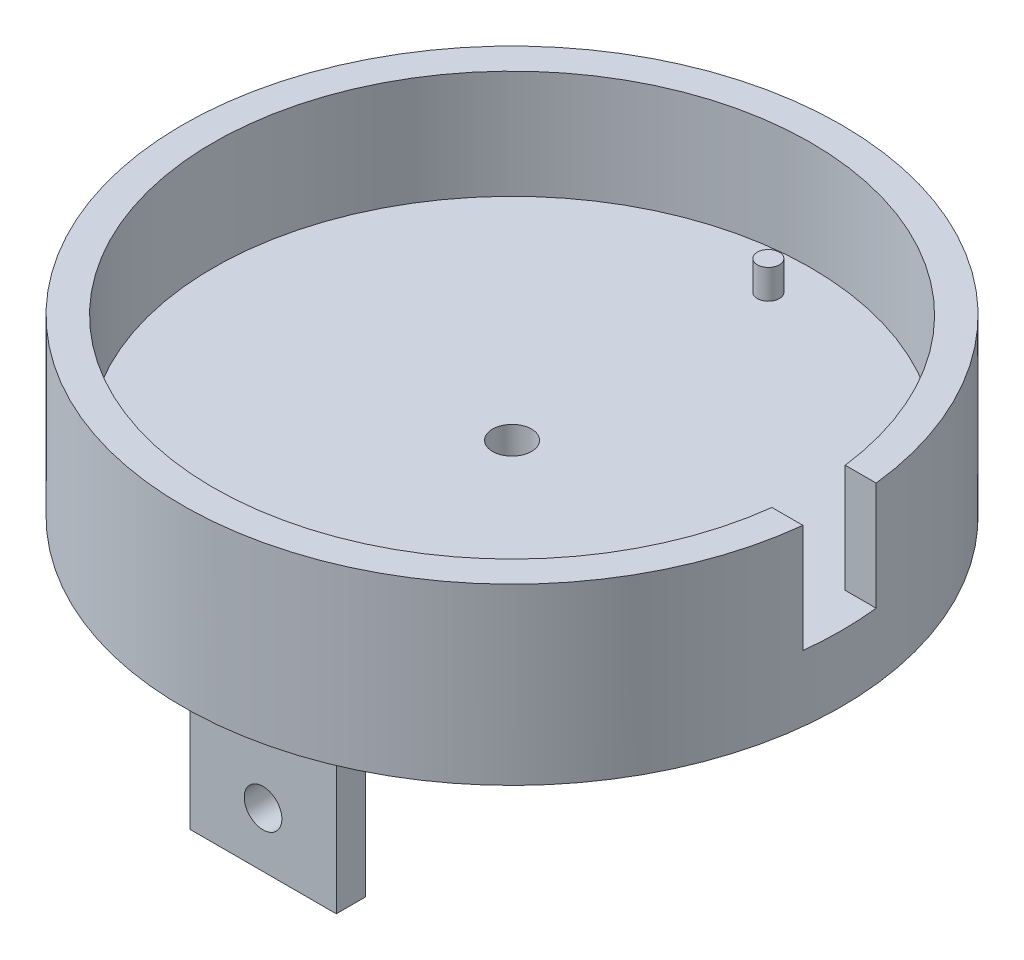
ISO-10303-21;
HEADER;
FILE_DESCRIPTION(('STEP AP214'),'2;1');
FILE_NAME('part.step','',(''),(''),'','','');
FILE_SCHEMA(('AUTOMOTIVE_DESIGN { 1 0 10303 214 1 1 1 1 }'));
ENDSEC;
DATA;
#1=APPLICATION_CONTEXT('core data for automotive mechanical design processes');
#2=APPLICATION_PROTOCOL_DEFINITION('international standard','automotive_design',2000,#1);
#3=PRODUCT_CONTEXT('',#1,'mechanical');
#4=PRODUCT('Part','Part','',(#3));
#5=PRODUCT_RELATED_PRODUCT_CATEGORY('part','',(#4));
#6=PRODUCT_DEFINITION_FORMATION('','',#4);
#7=PRODUCT_DEFINITION_CONTEXT('part definition',#1,'design');
#8=PRODUCT_DEFINITION('design','',#6,#7);
#9=PRODUCT_DEFINITION_SHAPE('','',#8);
#10=(LENGTH_UNIT() NAMED_UNIT(*) SI_UNIT(.MILLI.,.METRE.));
#11=(NAMED_UNIT(*) PLANE_ANGLE_UNIT() SI_UNIT($,.RADIAN.));
#12=(NAMED_UNIT(*) SI_UNIT($,.STERADIAN.) SOLID_ANGLE_UNIT());
#13=UNCERTAINTY_MEASURE_WITH_UNIT(LENGTH_MEASURE(1.E-05),#10,'distance_accuracy_value','');
#14=(GEOMETRIC_REPRESENTATION_CONTEXT(3) GLOBAL_UNCERTAINTY_ASSIGNED_CONTEXT((#13)) GLOBAL_UNIT_ASSIGNED_CONTEXT((#10,
#11,#12)) REPRESENTATION_CONTEXT('',''));
#15=CARTESIAN_POINT('',(0.,0.,0.));
#16=DIRECTION('',(0.,0.,1.));
#17=DIRECTION('',(1.,0.,0.));
#18=AXIS2_PLACEMENT_3D('',#15,#16,#17);
#19=CARTESIAN_POINT('',(0.,0.,0.));
#20=DIRECTION('',(0.,-1.,0.));
#21=DIRECTION('',(0.,0.,-1.));
#22=AXIS2_PLACEMENT_3D('',#19,#20,#21);
#23=PLANE('',#22);
#24=DIRECTION('',(-1.,0.,0.));
#25=VECTOR('',#24,1.);
#26=CARTESIAN_POINT('',(-12.7,0.,38.1));
#27=LINE('',#26,#25);
#28=CARTESIAN_POINT('',(19.05,0.,38.1));
#29=VERTEX_POINT('',#28);
#30=CARTESIAN_POINT('',(-19.05,0.,38.1));
#31=VERTEX_POINT('',#30);
#32=EDGE_CURVE('E187',#29,#31,#27,.T.);
#33=ORIENTED_EDGE('',*,*,#32,.T.);
#34=DIRECTION('',(0.,0.,1.));
#35=VECTOR('',#34,1.);
#36=CARTESIAN_POINT('',(-19.05,0.,43.18));
#37=LINE('',#36,#35);
#38=CARTESIAN_POINT('',(-19.05,0.,49.53));
#39=VERTEX_POINT('',#38);
#40=EDGE_CURVE('E273',#31,#39,#37,.T.);
#41=ORIENTED_EDGE('',*,*,#40,.T.);
#42=DIRECTION('',(1.,0.,0.));
#43=VECTOR('',#42,1.);
#44=CARTESIAN_POINT('',(12.7,0.,49.53));
#45=LINE('',#44,#43);
#46=CARTESIAN_POINT('',(19.05,0.,49.53));
#47=VERTEX_POINT('',#46);
#48=EDGE_CURVE('E266',#39,#47,#45,.T.);
#49=ORIENTED_EDGE('',*,*,#48,.T.);
#50=DIRECTION('',(0.,0.,-1.));
#51=VECTOR('',#50,1.);
#52=CARTESIAN_POINT('',(19.05,0.,38.1));
#53=LINE('',#52,#51);
#54=EDGE_CURVE('E270',#47,#29,#53,.T.);
#55=ORIENTED_EDGE('',*,*,#54,.T.);
#56=EDGE_LOOP('',(#33,#41,#49,#55));
#57=FACE_BOUND('',#56,.T.);
#58=DIRECTION('',(1.,0.,0.));
#59=VECTOR('',#58,1.);
#60=CARTESIAN_POINT('',(-12.7,0.,-38.1));
#61=LINE('',#60,#59);
#62=CARTESIAN_POINT('',(-19.05,0.,-38.1));
#63=VERTEX_POINT('',#62);
#64=CARTESIAN_POINT('',(19.05,0.,-38.1));
#65=VERTEX_POINT('',#64);
#66=EDGE_CURVE('E176',#63,#65,#61,.T.);
#67=ORIENTED_EDGE('',*,*,#66,.T.);
#68=DIRECTION('',(0.,0.,-1.));
#69=VECTOR('',#68,1.);
#70=CARTESIAN_POINT('',(19.05,0.,-43.18));
#71=LINE('',#70,#69);
#72=CARTESIAN_POINT('',(19.05,0.,-49.53));
#73=VERTEX_POINT('',#72);
#74=EDGE_CURVE('E281',#65,#73,#71,.T.);
#75=ORIENTED_EDGE('',*,*,#74,.T.);
#76=DIRECTION('',(-1.,0.,0.));
#77=VECTOR('',#76,1.);
#78=CARTESIAN_POINT('',(-12.7,0.,-49.53));
#79=LINE('',#78,#77);
#80=CARTESIAN_POINT('',(-19.05,0.,-49.53));
#81=VERTEX_POINT('',#80);
#82=EDGE_CURVE('E279',#73,#81,#79,.T.);
#83=ORIENTED_EDGE('',*,*,#82,.T.);
#84=DIRECTION('',(0.,0.,1.));
#85=VECTOR('',#84,1.);
#86=CARTESIAN_POINT('',(-19.05,0.,-38.1));
#87=LINE('',#86,#85);
#88=EDGE_CURVE('E276',#81,#63,#87,.T.);
#89=ORIENTED_EDGE('',*,*,#88,.T.);
#90=EDGE_LOOP('',(#67,#75,#83,#89));
#91=FACE_BOUND('',#90,.T.);
#92=CARTESIAN_POINT('',(0.,0.,0.));
#93=DIRECTION('',(0.,-1.,0.));
#94=DIRECTION('',(0.,0.,-1.));
#95=AXIS2_PLACEMENT_3D('',#92,#93,#94);
#96=CIRCLE('',#95,3.3782);
#97=CARTESIAN_POINT('',(0.,0.,-3.3782));
#98=VERTEX_POINT('',#97);
#99=EDGE_CURVE('E225',#98,#98,#96,.T.);
#100=ORIENTED_EDGE('',*,*,#99,.F.);
#101=EDGE_LOOP('',(#100));
#102=FACE_BOUND('',#101,.T.);
#103=CARTESIAN_POINT('',(0.,0.,0.));
#104=DIRECTION('',(0.,-1.,0.));
#105=DIRECTION('',(0.,0.,-1.));
#106=AXIS2_PLACEMENT_3D('',#103,#104,#105);
#107=CIRCLE('',#106,57.15);
#108=CARTESIAN_POINT('',(0.,0.,-57.15));
#109=VERTEX_POINT('',#108);
#110=EDGE_CURVE('E263',#109,#109,#107,.T.);
#111=ORIENTED_EDGE('',*,*,#110,.T.);
#112=EDGE_LOOP('',(#111));
#113=FACE_BOUND('',#112,.T.);
#114=ADVANCED_FACE('F37',(#57,#91,#102,#113),#23,.T.);
#115=CARTESIAN_POINT('',(0.,0.,0.));
#116=DIRECTION('',(0.,-1.,0.));
#117=DIRECTION('',(0.,0.,-1.));
#118=AXIS2_PLACEMENT_3D('',#115,#116,#117);
#119=CYLINDRICAL_SURFACE('',#118,57.15);
#120=DIRECTION('',(0.,-1.,0.));
#121=VECTOR('',#120,1.);
#122=CARTESIAN_POINT('',(56.7961266284947,0.,-6.35));
#123=LINE('',#122,#121);
#124=CARTESIAN_POINT('',(56.7961266284947,11.43,-6.35));
#125=VERTEX_POINT('',#124);
#126=CARTESIAN_POINT('',(56.7961266284947,30.226,-6.35));
#127=VERTEX_POINT('',#126);
#128=EDGE_CURVE('E250',#125,#127,#123,.F.);
#129=ORIENTED_EDGE('',*,*,#128,.F.);
#130=CARTESIAN_POINT('',(0.,11.43,0.));
#131=DIRECTION('',(0.,-1.,0.));
#132=DIRECTION('',(0.,0.,-1.));
#133=AXIS2_PLACEMENT_3D('',#130,#131,#132);
#134=CIRCLE('',#133,57.15);
#135=CARTESIAN_POINT('',(56.7961266284947,11.43,6.35));
#136=VERTEX_POINT('',#135);
#137=EDGE_CURVE('E252',#136,#125,#134,.F.);
#138=ORIENTED_EDGE('',*,*,#137,.F.);
#139=DIRECTION('',(0.,-1.,0.));
#140=VECTOR('',#139,1.);
#141=CARTESIAN_POINT('',(56.7961266284947,0.,6.35));
#142=LINE('',#141,#140);
#143=CARTESIAN_POINT('',(56.7961266284947,30.226,6.35));
#144=VERTEX_POINT('',#143);
#145=EDGE_CURVE('E243',#144,#136,#142,.T.);
#146=ORIENTED_EDGE('',*,*,#145,.F.);
#147=CARTESIAN_POINT('',(0.,30.226,0.));
#148=DIRECTION('',(0.,-1.,0.));
#149=DIRECTION('',(0.,0.,-1.));
#150=AXIS2_PLACEMENT_3D('',#147,#148,#149);
#151=CIRCLE('',#150,57.15);
#152=EDGE_CURVE('E260',#144,#127,#151,.T.);
#153=ORIENTED_EDGE('',*,*,#152,.T.);
#154=EDGE_LOOP('',(#129,#138,#146,#153));
#155=FACE_BOUND('',#154,.T.);
#156=ORIENTED_EDGE('',*,*,#110,.F.);
#157=EDGE_LOOP('',(#156));
#158=FACE_BOUND('',#157,.T.);
#159=ADVANCED_FACE('F348',(#155,#158),#119,.T.);
#160=CARTESIAN_POINT('',(-57.15,30.226,-3.9907631702977E-13));
#161=DIRECTION('',(0.,1.,0.));
#162=DIRECTION('',(0.,0.,1.));
#163=AXIS2_PLACEMENT_3D('',#160,#161,#162);
#164=PLANE('',#163);
#165=DIRECTION('',(1.,0.,0.));
#166=VECTOR('',#165,1.);
#167=CARTESIAN_POINT('',(-57.151,30.226,-6.35));
#168=LINE('',#167,#166);
#169=CARTESIAN_POINT('',(51.4254349130856,30.226,-6.35));
#170=VERTEX_POINT('',#169);
#171=EDGE_CURVE('E239',#170,#127,#168,.T.);
#172=ORIENTED_EDGE('',*,*,#171,.T.);
#173=ORIENTED_EDGE('',*,*,#152,.F.);
#174=DIRECTION('',(1.,0.,0.));
#175=VECTOR('',#174,1.);
#176=CARTESIAN_POINT('',(-57.151,30.226,6.35));
#177=LINE('',#176,#175);
#178=CARTESIAN_POINT('',(51.4254349130856,30.226,6.35));
#179=VERTEX_POINT('',#178);
#180=EDGE_CURVE('E235',#179,#144,#177,.T.);
#181=ORIENTED_EDGE('',*,*,#180,.F.);
#182=CARTESIAN_POINT('',(0.,30.226,0.));
#183=DIRECTION('',(0.,-1.,0.));
#184=DIRECTION('',(0.,0.,-1.));
#185=AXIS2_PLACEMENT_3D('',#182,#183,#184);
#186=CIRCLE('',#185,51.816);
#187=EDGE_CURVE('E257',#179,#170,#186,.T.);
#188=ORIENTED_EDGE('',*,*,#187,.T.);
#189=EDGE_LOOP('',(#172,#173,#181,#188));
#190=FACE_BOUND('',#189,.T.);
#191=ADVANCED_FACE('F353',(#190),#164,.T.);
#192=CARTESIAN_POINT('',(0.,0.,0.));
#193=DIRECTION('',(0.,-1.,0.));
#194=DIRECTION('',(0.,0.,-1.));
#195=AXIS2_PLACEMENT_3D('',#192,#193,#194);
#196=CYLINDRICAL_SURFACE('',#195,51.816);
#197=DIRECTION('',(0.,-1.,0.));
#198=VECTOR('',#197,1.);
#199=CARTESIAN_POINT('',(51.4254349130856,0.,-6.35));
#200=LINE('',#199,#198);
#201=CARTESIAN_POINT('',(51.4254349130856,11.43,-6.35));
#202=VERTEX_POINT('',#201);
#203=EDGE_CURVE('E236',#202,#170,#200,.F.);
#204=ORIENTED_EDGE('',*,*,#203,.T.);
#205=ORIENTED_EDGE('',*,*,#187,.F.);
#206=DIRECTION('',(0.,-1.,0.));
#207=VECTOR('',#206,1.);
#208=CARTESIAN_POINT('',(51.4254349130856,0.,6.35));
#209=LINE('',#208,#207);
#210=CARTESIAN_POINT('',(51.4254349130856,11.43,6.35));
#211=VERTEX_POINT('',#210);
#212=EDGE_CURVE('E231',#179,#211,#209,.T.);
#213=ORIENTED_EDGE('',*,*,#212,.T.);
#214=CARTESIAN_POINT('',(0.,11.43,0.));
#215=DIRECTION('',(0.,-1.,0.));
#216=DIRECTION('',(0.,0.,-1.));
#217=AXIS2_PLACEMENT_3D('',#214,#215,#216);
#218=CIRCLE('',#217,51.816);
#219=EDGE_CURVE('E254',#211,#202,#218,.T.);
#220=ORIENTED_EDGE('',*,*,#219,.T.);
#221=EDGE_LOOP('',(#204,#205,#213,#220));
#222=FACE_BOUND('',#221,.T.);
#223=ADVANCED_FACE('F471',(#222),#196,.F.);
#224=CARTESIAN_POINT('',(-51.816,11.43,-3.61829194106992E-13));
#225=DIRECTION('',(0.,1.,0.));
#226=DIRECTION('',(0.,0.,1.));
#227=AXIS2_PLACEMENT_3D('',#224,#225,#226);
#228=PLANE('',#227);
#229=CARTESIAN_POINT('',(0.,11.43,44.45));
#230=DIRECTION('',(0.,1.,0.));
#231=DIRECTION('',(0.,0.,-1.));
#232=AXIS2_PLACEMENT_3D('',#229,#230,#231);
#233=CIRCLE('',#232,1.905);
#234=CARTESIAN_POINT('',(0.,11.43,42.545));
#235=VERTEX_POINT('',#234);
#236=EDGE_CURVE('E208',#235,#235,#233,.T.);
#237=ORIENTED_EDGE('',*,*,#236,.F.);
#238=EDGE_LOOP('',(#237));
#239=FACE_BOUND('',#238,.T.);
#240=CARTESIAN_POINT('',(0.,11.43,-44.45));
#241=DIRECTION('',(0.,1.,0.));
#242=DIRECTION('',(0.,0.,1.));
#243=AXIS2_PLACEMENT_3D('',#240,#241,#242);
#244=CIRCLE('',#243,1.905);
#245=CARTESIAN_POINT('',(0.,11.43,-42.545));
#246=VERTEX_POINT('',#245);
#247=EDGE_CURVE('E219',#246,#246,#244,.T.);
#248=ORIENTED_EDGE('',*,*,#247,.F.);
#249=EDGE_LOOP('',(#248));
#250=FACE_BOUND('',#249,.T.);
#251=CARTESIAN_POINT('',(0.,11.43,0.));
#252=DIRECTION('',(0.,1.,0.));
#253=DIRECTION('',(0.,0.,1.));
#254=AXIS2_PLACEMENT_3D('',#251,#252,#253);
#255=CIRCLE('',#254,3.3782);
#256=CARTESIAN_POINT('',(0.,11.43,3.3782));
#257=VERTEX_POINT('',#256);
#258=EDGE_CURVE('E230',#257,#257,#255,.T.);
#259=ORIENTED_EDGE('',*,*,#258,.F.);
#260=EDGE_LOOP('',(#259));
#261=FACE_BOUND('',#260,.T.);
#262=ORIENTED_EDGE('',*,*,#219,.F.);
#263=DIRECTION('',(1.,0.,0.));
#264=VECTOR('',#263,1.);
#265=CARTESIAN_POINT('',(-57.151,11.43,6.35));
#266=LINE('',#265,#264);
#267=EDGE_CURVE('E234',#211,#136,#266,.T.);
#268=ORIENTED_EDGE('',*,*,#267,.T.);
#269=ORIENTED_EDGE('',*,*,#137,.T.);
#270=DIRECTION('',(1.,0.,0.));
#271=VECTOR('',#270,1.);
#272=CARTESIAN_POINT('',(-57.151,11.43,-6.35));
#273=LINE('',#272,#271);
#274=EDGE_CURVE('E240',#202,#125,#273,.T.);
#275=ORIENTED_EDGE('',*,*,#274,.F.);
#276=EDGE_LOOP('',(#262,#268,#269,#275));
#277=FACE_BOUND('',#276,.T.);
#278=ADVANCED_FACE('F479',(#239,#250,#261,#277),#228,.T.);
#279=CARTESIAN_POINT('',(-57.151,11.43,-6.35));
#280=DIRECTION('',(0.,0.,-1.));
#281=DIRECTION('',(0.,1.,0.));
#282=AXIS2_PLACEMENT_3D('',#279,#280,#281);
#283=PLANE('',#282);
#284=ORIENTED_EDGE('',*,*,#128,.T.);
#285=ORIENTED_EDGE('',*,*,#171,.F.);
#286=ORIENTED_EDGE('',*,*,#203,.F.);
#287=ORIENTED_EDGE('',*,*,#274,.T.);
#288=EDGE_LOOP('',(#284,#285,#286,#287));
#289=FACE_BOUND('',#288,.T.);
#290=ADVANCED_FACE('F488',(#289),#283,.F.);
#291=CARTESIAN_POINT('',(-57.151,11.43,6.35));
#292=DIRECTION('',(0.,0.,1.));
#293=DIRECTION('',(0.,-1.,0.));
#294=AXIS2_PLACEMENT_3D('',#291,#292,#293);
#295=PLANE('',#294);
#296=ORIENTED_EDGE('',*,*,#145,.T.);
#297=ORIENTED_EDGE('',*,*,#267,.F.);
#298=ORIENTED_EDGE('',*,*,#212,.F.);
#299=ORIENTED_EDGE('',*,*,#180,.T.);
#300=EDGE_LOOP('',(#296,#297,#298,#299));
#301=FACE_BOUND('',#300,.T.);
#302=ADVANCED_FACE('F502',(#301),#295,.F.);
#303=CARTESIAN_POINT('',(0.,30.226,0.));
#304=DIRECTION('',(0.,-1.,0.));
#305=DIRECTION('',(0.,0.,-1.));
#306=AXIS2_PLACEMENT_3D('',#303,#304,#305);
#307=CYLINDRICAL_SURFACE('',#306,3.3782);
#308=ORIENTED_EDGE('',*,*,#258,.T.);
#309=EDGE_LOOP('',(#308));
#310=FACE_BOUND('',#309,.T.);
#311=ORIENTED_EDGE('',*,*,#99,.T.);
#312=EDGE_LOOP('',(#311));
#313=FACE_BOUND('',#312,.T.);
#314=ADVANCED_FACE('F511',(#310,#313),#307,.F.);
#315=CARTESIAN_POINT('',(0.,16.51,-44.45));
#316=DIRECTION('',(0.,-1.,0.));
#317=DIRECTION('',(0.,0.,-1.));
#318=AXIS2_PLACEMENT_3D('',#315,#316,#317);
#319=CYLINDRICAL_SURFACE('',#318,1.905);
#320=CARTESIAN_POINT('',(0.,16.51,-44.45));
#321=DIRECTION('',(0.,1.,0.));
#322=DIRECTION('',(0.,0.,1.));
#323=AXIS2_PLACEMENT_3D('',#320,#321,#322);
#324=CIRCLE('',#323,1.905);
#325=CARTESIAN_POINT('',(0.,16.51,-42.545));
#326=VERTEX_POINT('',#325);
#327=EDGE_CURVE('E222',#326,#326,#324,.T.);
#328=ORIENTED_EDGE('',*,*,#327,.F.);
#329=EDGE_LOOP('',(#328));
#330=FACE_BOUND('',#329,.T.);
#331=ORIENTED_EDGE('',*,*,#247,.T.);
#332=EDGE_LOOP('',(#331));
#333=FACE_BOUND('',#332,.T.);
#334=ADVANCED_FACE('F519',(#330,#333),#319,.T.);
#335=CARTESIAN_POINT('',(0.,16.51,-44.45));
#336=DIRECTION('',(0.,1.,0.));
#337=DIRECTION('',(0.,0.,1.));
#338=AXIS2_PLACEMENT_3D('',#335,#336,#337);
#339=PLANE('',#338);
#340=ORIENTED_EDGE('',*,*,#327,.T.);
#341=EDGE_LOOP('',(#340));
#342=FACE_BOUND('',#341,.T.);
#343=ADVANCED_FACE('F527',(#342),#339,.T.);
#344=CARTESIAN_POINT('',(0.,16.51,44.45));
#345=DIRECTION('',(0.,-1.,0.));
#346=DIRECTION('',(0.,0.,-1.));
#347=AXIS2_PLACEMENT_3D('',#344,#345,#346);
#348=CYLINDRICAL_SURFACE('',#347,1.905);
#349=CARTESIAN_POINT('',(0.,16.51,44.45));
#350=DIRECTION('',(0.,1.,0.));
#351=DIRECTION('',(0.,0.,-1.));
#352=AXIS2_PLACEMENT_3D('',#349,#350,#351);
#353=CIRCLE('',#352,1.905);
#354=CARTESIAN_POINT('',(0.,16.51,42.545));
#355=VERTEX_POINT('',#354);
#356=EDGE_CURVE('E216',#355,#355,#353,.T.);
#357=ORIENTED_EDGE('',*,*,#356,.F.);
#358=EDGE_LOOP('',(#357));
#359=FACE_BOUND('',#358,.T.);
#360=ORIENTED_EDGE('',*,*,#236,.T.);
#361=EDGE_LOOP('',(#360));
#362=FACE_BOUND('',#361,.T.);
#363=ADVANCED_FACE('F536',(#359,#362),#348,.T.);
#364=CARTESIAN_POINT('',(0.,16.51,44.45));
#365=DIRECTION('',(0.,-1.,0.));
#366=DIRECTION('',(0.,0.,-1.));
#367=AXIS2_PLACEMENT_3D('',#364,#365,#366);
#368=PLANE('',#367);
#369=ORIENTED_EDGE('',*,*,#356,.T.);
#370=EDGE_LOOP('',(#369));
#371=FACE_BOUND('',#370,.T.);
#372=ADVANCED_FACE('F343',(#371),#368,.F.);
#373=CARTESIAN_POINT('',(12.7,-31.75,38.1));
#374=DIRECTION('',(1.,0.,0.));
#375=DIRECTION('',(0.,0.,-1.));
#376=AXIS2_PLACEMENT_3D('',#373,#374,#375);
#377=PLANE('',#376);
#378=DIRECTION('',(0.,1.,0.));
#379=VECTOR('',#378,1.);
#380=CARTESIAN_POINT('',(12.7,-31.75,38.1));
#381=LINE('',#380,#379);
#382=CARTESIAN_POINT('',(12.7,-31.75,38.1));
#383=VERTEX_POINT('',#382);
#384=CARTESIAN_POINT('',(12.7,-6.35,38.1));
#385=VERTEX_POINT('',#384);
#386=EDGE_CURVE('E204',#383,#385,#381,.T.);
#387=ORIENTED_EDGE('',*,*,#386,.T.);
#388=DIRECTION('',(0.,0.,-1.));
#389=VECTOR('',#388,1.);
#390=CARTESIAN_POINT('',(12.7,-6.35,43.18));
#391=LINE('',#390,#389);
#392=CARTESIAN_POINT('',(12.7,-6.35,43.18));
#393=VERTEX_POINT('',#392);
#394=EDGE_CURVE('E59',#385,#393,#391,.F.);
#395=ORIENTED_EDGE('',*,*,#394,.T.);
#396=DIRECTION('',(0.,1.,0.));
#397=VECTOR('',#396,1.);
#398=CARTESIAN_POINT('',(12.7,-31.75,43.18));
#399=LINE('',#398,#397);
#400=CARTESIAN_POINT('',(12.7,-31.75,43.18));
#401=VERTEX_POINT('',#400);
#402=EDGE_CURVE('E206',#401,#393,#399,.T.);
#403=ORIENTED_EDGE('',*,*,#402,.F.);
#404=DIRECTION('',(0.,0.,-1.));
#405=VECTOR('',#404,1.);
#406=CARTESIAN_POINT('',(12.7,-31.75,38.1));
#407=LINE('',#406,#405);
#408=EDGE_CURVE('E192',#401,#383,#407,.T.);
#409=ORIENTED_EDGE('',*,*,#408,.T.);
#410=EDGE_LOOP('',(#387,#395,#403,#409));
#411=FACE_BOUND('',#410,.T.);
#412=ADVANCED_FACE('F332',(#411),#377,.T.);
#413=CARTESIAN_POINT('',(-12.7,-31.75,43.18));
#414=DIRECTION('',(0.,0.,1.));
#415=DIRECTION('',(1.,0.,0.));
#416=AXIS2_PLACEMENT_3D('',#413,#414,#415);
#417=PLANE('',#416);
#418=CARTESIAN_POINT('',(0.,-22.225,43.18));
#419=DIRECTION('',(0.,0.,1.));
#420=DIRECTION('',(1.,0.,0.));
#421=AXIS2_PLACEMENT_3D('',#418,#419,#420);
#422=CIRCLE('',#421,3.2639);
#423=CARTESIAN_POINT('',(3.2639,-22.225,43.18));
#424=VERTEX_POINT('',#423);
#425=EDGE_CURVE('E181',#424,#424,#422,.T.);
#426=ORIENTED_EDGE('',*,*,#425,.F.);
#427=EDGE_LOOP('',(#426));
#428=FACE_BOUND('',#427,.T.);
#429=ORIENTED_EDGE('',*,*,#402,.T.);
#430=DIRECTION('',(1.,0.,0.));
#431=VECTOR('',#430,1.);
#432=CARTESIAN_POINT('',(-12.7,-6.35,43.18));
#433=LINE('',#432,#431);
#434=CARTESIAN_POINT('',(-12.7,-6.35,43.18));
#435=VERTEX_POINT('',#434);
#436=EDGE_CURVE('E293',#393,#435,#433,.F.);
#437=ORIENTED_EDGE('',*,*,#436,.T.);
#438=DIRECTION('',(0.,1.,0.));
#439=VECTOR('',#438,1.);
#440=CARTESIAN_POINT('',(-12.7,-31.75,43.18));
#441=LINE('',#440,#439);
#442=CARTESIAN_POINT('',(-12.7,-31.75,43.18));
#443=VERTEX_POINT('',#442);
#444=EDGE_CURVE('E209',#443,#435,#441,.T.);
#445=ORIENTED_EDGE('',*,*,#444,.F.);
#446=DIRECTION('',(1.,0.,0.));
#447=VECTOR('',#446,1.);
#448=CARTESIAN_POINT('',(-12.7,-31.75,43.18));
#449=LINE('',#448,#447);
#450=EDGE_CURVE('E201',#443,#401,#449,.T.);
#451=ORIENTED_EDGE('',*,*,#450,.T.);
#452=EDGE_LOOP('',(#429,#437,#445,#451));
#453=FACE_BOUND('',#452,.T.);
#454=ADVANCED_FACE('F334',(#428,#453),#417,.T.);
#455=CARTESIAN_POINT('',(-12.7,-31.75,38.1));
#456=DIRECTION('',(-1.,0.,0.));
#457=DIRECTION('',(0.,0.,1.));
#458=AXIS2_PLACEMENT_3D('',#455,#456,#457);
#459=PLANE('',#458);
#460=ORIENTED_EDGE('',*,*,#444,.T.);
#461=DIRECTION('',(0.,0.,1.));
#462=VECTOR('',#461,1.);
#463=CARTESIAN_POINT('',(-12.7,-6.35,38.1));
#464=LINE('',#463,#462);
#465=CARTESIAN_POINT('',(-12.7,-6.35,38.1));
#466=VERTEX_POINT('',#465);
#467=EDGE_CURVE('E290',#435,#466,#464,.F.);
#468=ORIENTED_EDGE('',*,*,#467,.T.);
#469=DIRECTION('',(0.,1.,0.));
#470=VECTOR('',#469,1.);
#471=CARTESIAN_POINT('',(-12.7,-31.75,38.1));
#472=LINE('',#471,#470);
#473=CARTESIAN_POINT('',(-12.7,-31.75,38.1));
#474=VERTEX_POINT('',#473);
#475=EDGE_CURVE('E212',#474,#466,#472,.T.);
#476=ORIENTED_EDGE('',*,*,#475,.F.);
#477=DIRECTION('',(0.,0.,1.));
#478=VECTOR('',#477,1.);
#479=CARTESIAN_POINT('',(-12.7,-31.75,38.1));
#480=LINE('',#479,#478);
#481=EDGE_CURVE('E198',#474,#443,#480,.T.);
#482=ORIENTED_EDGE('',*,*,#481,.T.);
#483=EDGE_LOOP('',(#460,#468,#476,#482));
#484=FACE_BOUND('',#483,.T.);
#485=ADVANCED_FACE('F324',(#484),#459,.T.);
#486=CARTESIAN_POINT('',(-12.7,-31.75,38.1));
#487=DIRECTION('',(0.,0.,-1.));
#488=DIRECTION('',(-1.,0.,0.));
#489=AXIS2_PLACEMENT_3D('',#486,#487,#488);
#490=PLANE('',#489);
#491=CARTESIAN_POINT('',(0.,-22.225,38.1));
#492=DIRECTION('',(0.,0.,-1.));
#493=DIRECTION('',(-1.,0.,0.));
#494=AXIS2_PLACEMENT_3D('',#491,#492,#493);
#495=CIRCLE('',#494,3.2639);
#496=CARTESIAN_POINT('',(-3.2639,-22.225,38.1));
#497=VERTEX_POINT('',#496);
#498=EDGE_CURVE('E643',#497,#497,#495,.T.);
#499=ORIENTED_EDGE('',*,*,#498,.F.);
#500=EDGE_LOOP('',(#499));
#501=FACE_BOUND('',#500,.T.);
#502=ORIENTED_EDGE('',*,*,#32,.F.);
#503=CARTESIAN_POINT('',(19.05,-6.35,38.1));
#504=DIRECTION('',(0.,0.,-1.));
#505=DIRECTION('',(-1.,0.,0.));
#506=AXIS2_PLACEMENT_3D('',#503,#504,#505);
#507=CIRCLE('',#506,6.35);
#508=EDGE_CURVE('E11',#29,#385,#507,.F.);
#509=ORIENTED_EDGE('',*,*,#508,.T.);
#510=ORIENTED_EDGE('',*,*,#386,.F.);
#511=DIRECTION('',(-1.,0.,0.));
#512=VECTOR('',#511,1.);
#513=CARTESIAN_POINT('',(-12.7,-31.75,38.1));
#514=LINE('',#513,#512);
#515=EDGE_CURVE('E195',#383,#474,#514,.T.);
#516=ORIENTED_EDGE('',*,*,#515,.T.);
#517=ORIENTED_EDGE('',*,*,#475,.T.);
#518=CARTESIAN_POINT('',(-19.05,-6.35,38.1));
#519=DIRECTION('',(0.,0.,-1.));
#520=DIRECTION('',(-1.,0.,0.));
#521=AXIS2_PLACEMENT_3D('',#518,#519,#520);
#522=CIRCLE('',#521,6.35);
#523=EDGE_CURVE('E46',#466,#31,#522,.F.);
#524=ORIENTED_EDGE('',*,*,#523,.T.);
#525=EDGE_LOOP('',(#502,#509,#510,#516,#517,#524));
#526=FACE_BOUND('',#525,.T.);
#527=ADVANCED_FACE('F326',(#501,#526),#490,.T.);
#528=CARTESIAN_POINT('',(0.,-31.75,0.));
#529=DIRECTION('',(0.,1.,0.));
#530=DIRECTION('',(0.,0.,1.));
#531=AXIS2_PLACEMENT_3D('',#528,#529,#530);
#532=PLANE('',#531);
#533=ORIENTED_EDGE('',*,*,#408,.F.);
#534=ORIENTED_EDGE('',*,*,#450,.F.);
#535=ORIENTED_EDGE('',*,*,#481,.F.);
#536=ORIENTED_EDGE('',*,*,#515,.F.);
#537=EDGE_LOOP('',(#533,#534,#535,#536));
#538=FACE_BOUND('',#537,.T.);
#539=ADVANCED_FACE('F330',(#538),#532,.F.);
#540=CARTESIAN_POINT('',(-12.7,-31.75,-38.1));
#541=DIRECTION('',(-1.,0.,0.));
#542=DIRECTION('',(0.,0.,1.));
#543=AXIS2_PLACEMENT_3D('',#540,#541,#542);
#544=PLANE('',#543);
#545=DIRECTION('',(0.,1.,0.));
#546=VECTOR('',#545,1.);
#547=CARTESIAN_POINT('',(-12.7,-31.75,-38.1));
#548=LINE('',#547,#546);
#549=CARTESIAN_POINT('',(-12.7,-31.75,-38.1));
#550=VERTEX_POINT('',#549);
#551=CARTESIAN_POINT('',(-12.7,-6.35,-38.1));
#552=VERTEX_POINT('',#551);
#553=EDGE_CURVE('E150',#550,#552,#548,.T.);
#554=ORIENTED_EDGE('',*,*,#553,.T.);
#555=DIRECTION('',(0.,0.,1.));
#556=VECTOR('',#555,1.);
#557=CARTESIAN_POINT('',(-12.7,-6.35,-43.18));
#558=LINE('',#557,#556);
#559=CARTESIAN_POINT('',(-12.7,-6.35,-43.18));
#560=VERTEX_POINT('',#559);
#561=EDGE_CURVE('E288',#552,#560,#558,.F.);
#562=ORIENTED_EDGE('',*,*,#561,.T.);
#563=DIRECTION('',(0.,1.,0.));
#564=VECTOR('',#563,1.);
#565=CARTESIAN_POINT('',(-12.7,-31.75,-43.18));
#566=LINE('',#565,#564);
#567=CARTESIAN_POINT('',(-12.7,-31.75,-43.18));
#568=VERTEX_POINT('',#567);
#569=EDGE_CURVE('E175',#568,#560,#566,.T.);
#570=ORIENTED_EDGE('',*,*,#569,.F.);
#571=DIRECTION('',(0.,0.,1.));
#572=VECTOR('',#571,1.);
#573=CARTESIAN_POINT('',(-12.7,-31.75,-38.1));
#574=LINE('',#573,#572);
#575=EDGE_CURVE('E168',#568,#550,#574,.T.);
#576=ORIENTED_EDGE('',*,*,#575,.T.);
#577=EDGE_LOOP('',(#554,#562,#570,#576));
#578=FACE_BOUND('',#577,.T.);
#579=ADVANCED_FACE('F173',(#578),#544,.T.);
#580=CARTESIAN_POINT('',(-12.7,-31.75,-43.18));
#581=DIRECTION('',(0.,0.,-1.));
#582=DIRECTION('',(-1.,0.,0.));
#583=AXIS2_PLACEMENT_3D('',#580,#581,#582);
#584=PLANE('',#583);
#585=CARTESIAN_POINT('',(0.,-22.225,-43.18));
#586=DIRECTION('',(0.,0.,-1.));
#587=DIRECTION('',(-1.,0.,0.));
#588=AXIS2_PLACEMENT_3D('',#585,#586,#587);
#589=CIRCLE('',#588,3.2639);
#590=CARTESIAN_POINT('',(-3.2639,-22.225,-43.18));
#591=VERTEX_POINT('',#590);
#592=EDGE_CURVE('E644',#591,#591,#589,.T.);
#593=ORIENTED_EDGE('',*,*,#592,.F.);
#594=EDGE_LOOP('',(#593));
#595=FACE_BOUND('',#594,.T.);
#596=ORIENTED_EDGE('',*,*,#569,.T.);
#597=DIRECTION('',(-1.,0.,0.));
#598=VECTOR('',#597,1.);
#599=CARTESIAN_POINT('',(12.7,-6.35,-43.18));
#600=LINE('',#599,#598);
#601=CARTESIAN_POINT('',(12.7,-6.35,-43.18));
#602=VERTEX_POINT('',#601);
#603=EDGE_CURVE('E286',#560,#602,#600,.F.);
#604=ORIENTED_EDGE('',*,*,#603,.T.);
#605=DIRECTION('',(0.,1.,0.));
#606=VECTOR('',#605,1.);
#607=CARTESIAN_POINT('',(12.7,-31.75,-43.18));
#608=LINE('',#607,#606);
#609=CARTESIAN_POINT('',(12.7,-31.75,-43.18));
#610=VERTEX_POINT('',#609);
#611=EDGE_CURVE('E188',#610,#602,#608,.T.);
#612=ORIENTED_EDGE('',*,*,#611,.F.);
#613=DIRECTION('',(-1.,0.,0.));
#614=VECTOR('',#613,1.);
#615=CARTESIAN_POINT('',(-12.7,-31.75,-43.18));
#616=LINE('',#615,#614);
#617=EDGE_CURVE('E161',#610,#568,#616,.T.);
#618=ORIENTED_EDGE('',*,*,#617,.T.);
#619=EDGE_LOOP('',(#596,#604,#612,#618));
#620=FACE_BOUND('',#619,.T.);
#621=ADVANCED_FACE('F413',(#595,#620),#584,.T.);
#622=CARTESIAN_POINT('',(12.7,-31.75,-38.1));
#623=DIRECTION('',(1.,0.,0.));
#624=DIRECTION('',(0.,0.,-1.));
#625=AXIS2_PLACEMENT_3D('',#622,#623,#624);
#626=PLANE('',#625);
#627=ORIENTED_EDGE('',*,*,#611,.T.);
#628=DIRECTION('',(0.,0.,-1.));
#629=VECTOR('',#628,1.);
#630=CARTESIAN_POINT('',(12.7,-6.35,-38.1));
#631=LINE('',#630,#629);
#632=CARTESIAN_POINT('',(12.7,-6.35,-38.1));
#633=VERTEX_POINT('',#632);
#634=EDGE_CURVE('E284',#602,#633,#631,.F.);
#635=ORIENTED_EDGE('',*,*,#634,.T.);
#636=DIRECTION('',(0.,1.,0.));
#637=VECTOR('',#636,1.);
#638=CARTESIAN_POINT('',(12.7,-31.75,-38.1));
#639=LINE('',#638,#637);
#640=CARTESIAN_POINT('',(12.7,-31.75,-38.1));
#641=VERTEX_POINT('',#640);
#642=EDGE_CURVE('E160',#641,#633,#639,.T.);
#643=ORIENTED_EDGE('',*,*,#642,.F.);
#644=DIRECTION('',(0.,0.,-1.));
#645=VECTOR('',#644,1.);
#646=CARTESIAN_POINT('',(12.7,-31.75,-38.1));
#647=LINE('',#646,#645);
#648=EDGE_CURVE('E171',#641,#610,#647,.T.);
#649=ORIENTED_EDGE('',*,*,#648,.T.);
#650=EDGE_LOOP('',(#627,#635,#643,#649));
#651=FACE_BOUND('',#650,.T.);
#652=ADVANCED_FACE('F404',(#651),#626,.T.);
#653=CARTESIAN_POINT('',(-12.7,-31.75,-38.1));
#654=DIRECTION('',(0.,0.,1.));
#655=DIRECTION('',(1.,0.,0.));
#656=AXIS2_PLACEMENT_3D('',#653,#654,#655);
#657=PLANE('',#656);
#658=CARTESIAN_POINT('',(0.,-22.225,-38.1));
#659=DIRECTION('',(0.,0.,1.));
#660=DIRECTION('',(1.,0.,0.));
#661=AXIS2_PLACEMENT_3D('',#658,#659,#660);
#662=CIRCLE('',#661,3.2639);
#663=CARTESIAN_POINT('',(3.2639,-22.225,-38.1));
#664=VERTEX_POINT('',#663);
#665=EDGE_CURVE('E41',#664,#664,#662,.T.);
#666=ORIENTED_EDGE('',*,*,#665,.F.);
#667=EDGE_LOOP('',(#666));
#668=FACE_BOUND('',#667,.T.);
#669=ORIENTED_EDGE('',*,*,#66,.F.);
#670=CARTESIAN_POINT('',(-19.05,-6.35,-38.1));
#671=DIRECTION('',(0.,0.,1.));
#672=DIRECTION('',(1.,0.,0.));
#673=AXIS2_PLACEMENT_3D('',#670,#671,#672);
#674=CIRCLE('',#673,6.35);
#675=EDGE_CURVE('E156',#63,#552,#674,.F.);
#676=ORIENTED_EDGE('',*,*,#675,.T.);
#677=ORIENTED_EDGE('',*,*,#553,.F.);
#678=DIRECTION('',(1.,0.,0.));
#679=VECTOR('',#678,1.);
#680=CARTESIAN_POINT('',(-12.7,-31.75,-38.1));
#681=LINE('',#680,#679);
#682=EDGE_CURVE('E154',#550,#641,#681,.T.);
#683=ORIENTED_EDGE('',*,*,#682,.T.);
#684=ORIENTED_EDGE('',*,*,#642,.T.);
#685=CARTESIAN_POINT('',(19.05,-6.35,-38.1));
#686=DIRECTION('',(0.,0.,1.));
#687=DIRECTION('',(1.,0.,0.));
#688=AXIS2_PLACEMENT_3D('',#685,#686,#687);
#689=CIRCLE('',#688,6.35);
#690=EDGE_CURVE('E295',#633,#65,#689,.F.);
#691=ORIENTED_EDGE('',*,*,#690,.T.);
#692=EDGE_LOOP('',(#669,#676,#677,#683,#684,#691));
#693=FACE_BOUND('',#692,.T.);
#694=ADVANCED_FACE('F152',(#668,#693),#657,.T.);
#695=CARTESIAN_POINT('',(0.,-31.75,0.));
#696=DIRECTION('',(0.,-1.,0.));
#697=DIRECTION('',(0.,0.,-1.));
#698=AXIS2_PLACEMENT_3D('',#695,#696,#697);
#699=PLANE('',#698);
#700=ORIENTED_EDGE('',*,*,#575,.F.);
#701=ORIENTED_EDGE('',*,*,#617,.F.);
#702=ORIENTED_EDGE('',*,*,#648,.F.);
#703=ORIENTED_EDGE('',*,*,#682,.F.);
#704=EDGE_LOOP('',(#700,#701,#702,#703));
#705=FACE_BOUND('',#704,.T.);
#706=ADVANCED_FACE('F166',(#705),#699,.T.);
#707=CARTESIAN_POINT('',(-19.05,-6.35,0.));
#708=DIRECTION('',(0.,0.,-1.));
#709=DIRECTION('',(-1.,0.,0.));
#710=AXIS2_PLACEMENT_3D('',#707,#708,#709);
#711=CYLINDRICAL_SURFACE('',#710,6.35);
#712=ORIENTED_EDGE('',*,*,#675,.F.);
#713=ORIENTED_EDGE('',*,*,#88,.F.);
#714=CARTESIAN_POINT('',(-19.05,-6.35,-49.53));
#715=DIRECTION('',(0.707106781186547,0.,-0.707106781186547));
#716=DIRECTION('',(-0.707106781186547,0.,-0.707106781186547));
#717=AXIS2_PLACEMENT_3D('',#714,#715,#716);
#718=ELLIPSE('',#717,8.98025612106915,6.35);
#719=EDGE_CURVE('E178',#560,#81,#718,.F.);
#720=ORIENTED_EDGE('',*,*,#719,.F.);
#721=ORIENTED_EDGE('',*,*,#561,.F.);
#722=EDGE_LOOP('',(#712,#713,#720,#721));
#723=FACE_BOUND('',#722,.T.);
#724=ADVANCED_FACE('F365',(#723),#711,.F.);
#725=CARTESIAN_POINT('',(0.,-6.35,-49.53));
#726=DIRECTION('',(1.,0.,0.));
#727=DIRECTION('',(0.,0.,-1.));
#728=AXIS2_PLACEMENT_3D('',#725,#726,#727);
#729=CYLINDRICAL_SURFACE('',#728,6.35);
#730=ORIENTED_EDGE('',*,*,#719,.T.);
#731=ORIENTED_EDGE('',*,*,#82,.F.);
#732=CARTESIAN_POINT('',(19.05,-6.35,-49.53));
#733=DIRECTION('',(0.707106781186548,0.,0.707106781186547));
#734=DIRECTION('',(0.707106781186547,0.,-0.707106781186548));
#735=AXIS2_PLACEMENT_3D('',#732,#733,#734);
#736=ELLIPSE('',#735,8.98025612106915,6.35);
#737=EDGE_CURVE('E301',#602,#73,#736,.F.);
#738=ORIENTED_EDGE('',*,*,#737,.F.);
#739=ORIENTED_EDGE('',*,*,#603,.F.);
#740=EDGE_LOOP('',(#730,#731,#738,#739));
#741=FACE_BOUND('',#740,.T.);
#742=ADVANCED_FACE('F361',(#741),#729,.F.);
#743=CARTESIAN_POINT('',(19.05,-6.35,0.));
#744=DIRECTION('',(0.,0.,1.));
#745=DIRECTION('',(1.,0.,0.));
#746=AXIS2_PLACEMENT_3D('',#743,#744,#745);
#747=CYLINDRICAL_SURFACE('',#746,6.35);
#748=ORIENTED_EDGE('',*,*,#690,.F.);
#749=ORIENTED_EDGE('',*,*,#634,.F.);
#750=ORIENTED_EDGE('',*,*,#737,.T.);
#751=ORIENTED_EDGE('',*,*,#74,.F.);
#752=EDGE_LOOP('',(#748,#749,#750,#751));
#753=FACE_BOUND('',#752,.T.);
#754=ADVANCED_FACE('F358',(#753),#747,.F.);
#755=CARTESIAN_POINT('',(19.05,-6.35,0.));
#756=DIRECTION('',(0.,0.,1.));
#757=DIRECTION('',(1.,0.,0.));
#758=AXIS2_PLACEMENT_3D('',#755,#756,#757);
#759=CYLINDRICAL_SURFACE('',#758,6.35);
#760=ORIENTED_EDGE('',*,*,#508,.F.);
#761=ORIENTED_EDGE('',*,*,#54,.F.);
#762=CARTESIAN_POINT('',(19.05,-6.35,49.53));
#763=DIRECTION('',(-0.707106781186547,0.,0.707106781186547));
#764=DIRECTION('',(-0.707106781186547,0.,-0.707106781186547));
#765=AXIS2_PLACEMENT_3D('',#762,#763,#764);
#766=ELLIPSE('',#765,8.98025612106915,6.35);
#767=EDGE_CURVE('E303',#393,#47,#766,.F.);
#768=ORIENTED_EDGE('',*,*,#767,.F.);
#769=ORIENTED_EDGE('',*,*,#394,.F.);
#770=EDGE_LOOP('',(#760,#761,#768,#769));
#771=FACE_BOUND('',#770,.T.);
#772=ADVANCED_FACE('F39',(#771),#759,.F.);
#773=CARTESIAN_POINT('',(0.,-6.35,49.53));
#774=DIRECTION('',(-1.,0.,0.));
#775=DIRECTION('',(0.,0.,1.));
#776=AXIS2_PLACEMENT_3D('',#773,#774,#775);
#777=CYLINDRICAL_SURFACE('',#776,6.35);
#778=ORIENTED_EDGE('',*,*,#767,.T.);
#779=ORIENTED_EDGE('',*,*,#48,.F.);
#780=CARTESIAN_POINT('',(-19.05,-6.35,49.53));
#781=DIRECTION('',(-0.707106781186548,0.,-0.707106781186547));
#782=DIRECTION('',(-0.707106781186547,0.,0.707106781186548));
#783=AXIS2_PLACEMENT_3D('',#780,#781,#782);
#784=ELLIPSE('',#783,8.98025612106915,6.35);
#785=EDGE_CURVE('E306',#435,#39,#784,.F.);
#786=ORIENTED_EDGE('',*,*,#785,.F.);
#787=ORIENTED_EDGE('',*,*,#436,.F.);
#788=EDGE_LOOP('',(#778,#779,#786,#787));
#789=FACE_BOUND('',#788,.T.);
#790=ADVANCED_FACE('F312',(#789),#777,.F.);
#791=CARTESIAN_POINT('',(-19.05,-6.35,0.));
#792=DIRECTION('',(0.,0.,-1.));
#793=DIRECTION('',(-1.,0.,0.));
#794=AXIS2_PLACEMENT_3D('',#791,#792,#793);
#795=CYLINDRICAL_SURFACE('',#794,6.35);
#796=ORIENTED_EDGE('',*,*,#523,.F.);
#797=ORIENTED_EDGE('',*,*,#467,.F.);
#798=ORIENTED_EDGE('',*,*,#785,.T.);
#799=ORIENTED_EDGE('',*,*,#40,.F.);
#800=EDGE_LOOP('',(#796,#797,#798,#799));
#801=FACE_BOUND('',#800,.T.);
#802=ADVANCED_FACE('F321',(#801),#795,.F.);
#803=CARTESIAN_POINT('',(0.,-22.225,-57.15));
#804=DIRECTION('',(0.,0.,1.));
#805=DIRECTION('',(1.,0.,0.));
#806=AXIS2_PLACEMENT_3D('',#803,#804,#805);
#807=CYLINDRICAL_SURFACE('',#806,3.2639);
#808=ORIENTED_EDGE('',*,*,#592,.T.);
#809=EDGE_LOOP('',(#808));
#810=FACE_BOUND('',#809,.T.);
#811=ORIENTED_EDGE('',*,*,#665,.T.);
#812=EDGE_LOOP('',(#811));
#813=FACE_BOUND('',#812,.T.);
#814=ADVANCED_FACE('F371',(#810,#813),#807,.F.);
#815=ORIENTED_EDGE('',*,*,#425,.T.);
#816=EDGE_LOOP('',(#815));
#817=FACE_BOUND('',#816,.T.);
#818=ORIENTED_EDGE('',*,*,#498,.T.);
#819=EDGE_LOOP('',(#818));
#820=FACE_BOUND('',#819,.T.);
#821=ADVANCED_FACE('F626',(#817,#820),#807,.F.);
#822=CLOSED_SHELL('',(#114,#159,#191,#223,#278,#290,#302,#314,#334,#343,#363,#372,#412,#454,
#485,#527,#539,#579,#621,#652,#694,#706,#724,#742,#754,#772,#790,#802,#814,#821));
#823=MANIFOLD_SOLID_BREP('B2',#822);
#824=ADVANCED_BREP_SHAPE_REPRESENTATION('',(#18,#823),#14);
#825=SHAPE_DEFINITION_REPRESENTATION(#9,#824);
ENDSEC;
END-ISO-10303-21;
